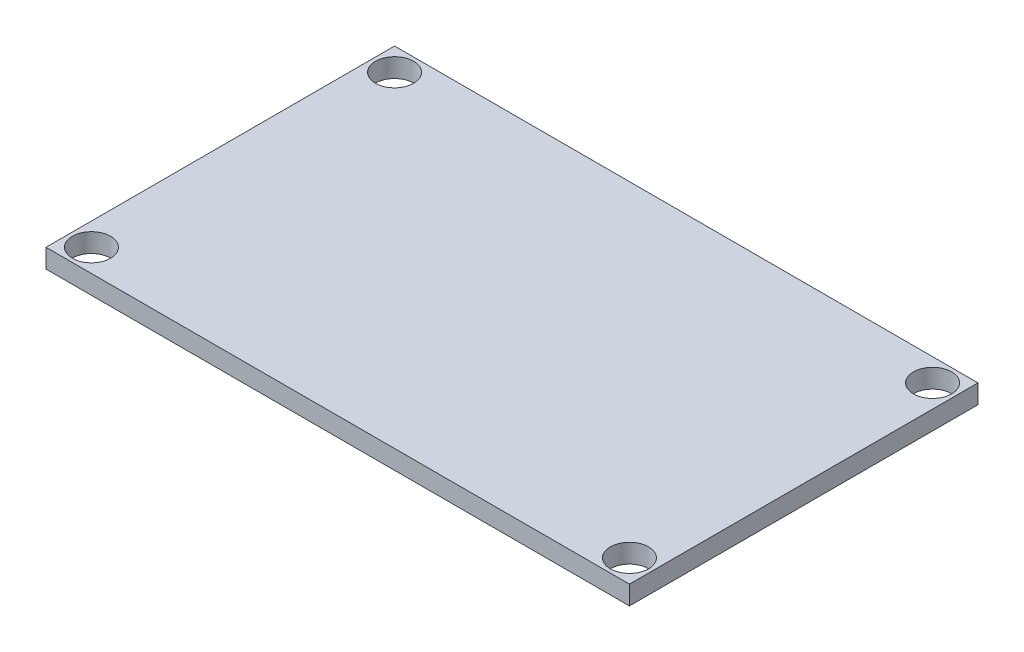
ISO-10303-21;
HEADER;
FILE_DESCRIPTION(('STEP AP214'),'2;1');
FILE_NAME('part.step','',(''),(''),'','','');
FILE_SCHEMA(('AUTOMOTIVE_DESIGN { 1 0 10303 214 1 1 1 1 }'));
ENDSEC;
DATA;
#1=APPLICATION_CONTEXT('core data for automotive mechanical design processes');
#2=APPLICATION_PROTOCOL_DEFINITION('international standard','automotive_design',2000,#1);
#3=PRODUCT_CONTEXT('',#1,'mechanical');
#4=PRODUCT('Part','Part','',(#3));
#5=PRODUCT_RELATED_PRODUCT_CATEGORY('part','',(#4));
#6=PRODUCT_DEFINITION_FORMATION('','',#4);
#7=PRODUCT_DEFINITION_CONTEXT('part definition',#1,'design');
#8=PRODUCT_DEFINITION('design','',#6,#7);
#9=PRODUCT_DEFINITION_SHAPE('','',#8);
#10=(LENGTH_UNIT() NAMED_UNIT(*) SI_UNIT(.MILLI.,.METRE.));
#11=(NAMED_UNIT(*) PLANE_ANGLE_UNIT() SI_UNIT($,.RADIAN.));
#12=(NAMED_UNIT(*) SI_UNIT($,.STERADIAN.) SOLID_ANGLE_UNIT());
#13=UNCERTAINTY_MEASURE_WITH_UNIT(LENGTH_MEASURE(1.E-05),#10,'distance_accuracy_value','');
#14=(GEOMETRIC_REPRESENTATION_CONTEXT(3) GLOBAL_UNCERTAINTY_ASSIGNED_CONTEXT((#13)) GLOBAL_UNIT_ASSIGNED_CONTEXT((#10,
#11,#12)) REPRESENTATION_CONTEXT('',''));
#15=CARTESIAN_POINT('',(0.,0.,0.));
#16=DIRECTION('',(0.,0.,1.));
#17=DIRECTION('',(1.,0.,0.));
#18=AXIS2_PLACEMENT_3D('',#15,#16,#17);
#19=CARTESIAN_POINT('',(0.,1.5875,0.));
#20=DIRECTION('',(0.,1.,0.));
#21=DIRECTION('',(0.,0.,1.));
#22=AXIS2_PLACEMENT_3D('',#19,#20,#21);
#23=PLANE('',#22);
#24=CARTESIAN_POINT('',(22.5425,1.5875,12.7));
#25=DIRECTION('',(0.,1.,0.));
#26=DIRECTION('',(0.,0.,1.));
#27=AXIS2_PLACEMENT_3D('',#24,#25,#26);
#28=CIRCLE('',#27,1.599999975);
#29=CARTESIAN_POINT('',(22.5425,1.5875,14.299999975));
#30=VERTEX_POINT('',#29);
#31=EDGE_CURVE('E121',#30,#30,#28,.T.);
#32=ORIENTED_EDGE('',*,*,#31,.F.);
#33=EDGE_LOOP('',(#32));
#34=FACE_BOUND('',#33,.T.);
#35=CARTESIAN_POINT('',(-22.5425,1.5875,-12.7));
#36=DIRECTION('',(0.,1.,0.));
#37=DIRECTION('',(0.,0.,1.));
#38=AXIS2_PLACEMENT_3D('',#35,#36,#37);
#39=CIRCLE('',#38,1.599999975);
#40=CARTESIAN_POINT('',(-22.5425,1.5875,-11.100000025));
#41=VERTEX_POINT('',#40);
#42=EDGE_CURVE('E100',#41,#41,#39,.T.);
#43=ORIENTED_EDGE('',*,*,#42,.F.);
#44=EDGE_LOOP('',(#43));
#45=FACE_BOUND('',#44,.T.);
#46=DIRECTION('',(0.,0.,-1.));
#47=VECTOR('',#46,1.);
#48=CARTESIAN_POINT('',(24.4475,1.5875,-14.605));
#49=LINE('',#48,#47);
#50=CARTESIAN_POINT('',(24.4475,1.5875,14.605));
#51=VERTEX_POINT('',#50);
#52=CARTESIAN_POINT('',(24.4475,1.5875,-14.605));
#53=VERTEX_POINT('',#52);
#54=EDGE_CURVE('E85',#51,#53,#49,.T.);
#55=ORIENTED_EDGE('',*,*,#54,.T.);
#56=DIRECTION('',(-1.,0.,0.));
#57=VECTOR('',#56,1.);
#58=CARTESIAN_POINT('',(-24.4475,1.5875,-14.605));
#59=LINE('',#58,#57);
#60=CARTESIAN_POINT('',(-24.4475,1.5875,-14.605));
#61=VERTEX_POINT('',#60);
#62=EDGE_CURVE('E80',#53,#61,#59,.T.);
#63=ORIENTED_EDGE('',*,*,#62,.T.);
#64=DIRECTION('',(0.,0.,1.));
#65=VECTOR('',#64,1.);
#66=CARTESIAN_POINT('',(-24.4475,1.5875,-14.605));
#67=LINE('',#66,#65);
#68=CARTESIAN_POINT('',(-24.4475,1.5875,14.605));
#69=VERTEX_POINT('',#68);
#70=EDGE_CURVE('E83',#61,#69,#67,.T.);
#71=ORIENTED_EDGE('',*,*,#70,.T.);
#72=DIRECTION('',(1.,0.,0.));
#73=VECTOR('',#72,1.);
#74=CARTESIAN_POINT('',(-24.4475,1.5875,14.605));
#75=LINE('',#74,#73);
#76=EDGE_CURVE('E50',#69,#51,#75,.T.);
#77=ORIENTED_EDGE('',*,*,#76,.T.);
#78=EDGE_LOOP('',(#55,#63,#71,#77));
#79=FACE_BOUND('',#78,.T.);
#80=CARTESIAN_POINT('',(-22.5425,1.5875,12.7));
#81=DIRECTION('',(0.,1.,0.));
#82=DIRECTION('',(0.,0.,1.));
#83=AXIS2_PLACEMENT_3D('',#80,#81,#82);
#84=CIRCLE('',#83,1.599999975);
#85=CARTESIAN_POINT('',(-22.5425,1.5875,14.299999975));
#86=VERTEX_POINT('',#85);
#87=EDGE_CURVE('E115',#86,#86,#84,.T.);
#88=ORIENTED_EDGE('',*,*,#87,.F.);
#89=EDGE_LOOP('',(#88));
#90=FACE_BOUND('',#89,.T.);
#91=CARTESIAN_POINT('',(22.5425,1.5875,-12.7));
#92=DIRECTION('',(0.,1.,0.));
#93=DIRECTION('',(0.,0.,1.));
#94=AXIS2_PLACEMENT_3D('',#91,#92,#93);
#95=CIRCLE('',#94,1.599999975);
#96=CARTESIAN_POINT('',(22.5425,1.5875,-11.100000025));
#97=VERTEX_POINT('',#96);
#98=EDGE_CURVE('E127',#97,#97,#95,.T.);
#99=ORIENTED_EDGE('',*,*,#98,.F.);
#100=EDGE_LOOP('',(#99));
#101=FACE_BOUND('',#100,.T.);
#102=ADVANCED_FACE('F33',(#34,#45,#79,#90,#101),#23,.T.);
#103=CARTESIAN_POINT('',(0.,0.,0.));
#104=DIRECTION('',(0.,1.,0.));
#105=DIRECTION('',(0.,0.,1.));
#106=AXIS2_PLACEMENT_3D('',#103,#104,#105);
#107=PLANE('',#106);
#108=DIRECTION('',(0.,0.,-1.));
#109=VECTOR('',#108,1.);
#110=CARTESIAN_POINT('',(24.4475,0.,-14.605));
#111=LINE('',#110,#109);
#112=CARTESIAN_POINT('',(24.4475,0.,14.605));
#113=VERTEX_POINT('',#112);
#114=CARTESIAN_POINT('',(24.4475,0.,-14.605));
#115=VERTEX_POINT('',#114);
#116=EDGE_CURVE('E97',#113,#115,#111,.T.);
#117=ORIENTED_EDGE('',*,*,#116,.F.);
#118=DIRECTION('',(1.,0.,0.));
#119=VECTOR('',#118,1.);
#120=CARTESIAN_POINT('',(-24.4475,0.,14.605));
#121=LINE('',#120,#119);
#122=CARTESIAN_POINT('',(-24.4475,0.,14.605));
#123=VERTEX_POINT('',#122);
#124=EDGE_CURVE('E73',#123,#113,#121,.T.);
#125=ORIENTED_EDGE('',*,*,#124,.F.);
#126=DIRECTION('',(0.,0.,1.));
#127=VECTOR('',#126,1.);
#128=CARTESIAN_POINT('',(-24.4475,0.,-14.605));
#129=LINE('',#128,#127);
#130=CARTESIAN_POINT('',(-24.4475,0.,-14.605));
#131=VERTEX_POINT('',#130);
#132=EDGE_CURVE('E67',#131,#123,#129,.T.);
#133=ORIENTED_EDGE('',*,*,#132,.F.);
#134=DIRECTION('',(-1.,0.,0.));
#135=VECTOR('',#134,1.);
#136=CARTESIAN_POINT('',(-24.4475,0.,-14.605));
#137=LINE('',#136,#135);
#138=EDGE_CURVE('E89',#115,#131,#137,.T.);
#139=ORIENTED_EDGE('',*,*,#138,.F.);
#140=EDGE_LOOP('',(#117,#125,#133,#139));
#141=FACE_BOUND('',#140,.T.);
#142=CARTESIAN_POINT('',(-22.5425,0.,-12.7));
#143=DIRECTION('',(0.,1.,0.));
#144=DIRECTION('',(0.,0.,1.));
#145=AXIS2_PLACEMENT_3D('',#142,#143,#144);
#146=CIRCLE('',#145,1.599999975);
#147=CARTESIAN_POINT('',(-22.5425,0.,-11.100000025));
#148=VERTEX_POINT('',#147);
#149=EDGE_CURVE('E112',#148,#148,#146,.T.);
#150=ORIENTED_EDGE('',*,*,#149,.T.);
#151=EDGE_LOOP('',(#150));
#152=FACE_BOUND('',#151,.T.);
#153=CARTESIAN_POINT('',(-22.5425,0.,12.7));
#154=DIRECTION('',(0.,1.,0.));
#155=DIRECTION('',(0.,0.,1.));
#156=AXIS2_PLACEMENT_3D('',#153,#154,#155);
#157=CIRCLE('',#156,1.599999975);
#158=CARTESIAN_POINT('',(-22.5425,0.,14.299999975));
#159=VERTEX_POINT('',#158);
#160=EDGE_CURVE('E118',#159,#159,#157,.T.);
#161=ORIENTED_EDGE('',*,*,#160,.T.);
#162=EDGE_LOOP('',(#161));
#163=FACE_BOUND('',#162,.T.);
#164=CARTESIAN_POINT('',(22.5425,0.,12.7));
#165=DIRECTION('',(0.,1.,0.));
#166=DIRECTION('',(0.,0.,1.));
#167=AXIS2_PLACEMENT_3D('',#164,#165,#166);
#168=CIRCLE('',#167,1.599999975);
#169=CARTESIAN_POINT('',(22.5425,0.,14.299999975));
#170=VERTEX_POINT('',#169);
#171=EDGE_CURVE('E124',#170,#170,#168,.T.);
#172=ORIENTED_EDGE('',*,*,#171,.T.);
#173=EDGE_LOOP('',(#172));
#174=FACE_BOUND('',#173,.T.);
#175=CARTESIAN_POINT('',(22.5425,0.,-12.7));
#176=DIRECTION('',(0.,1.,0.));
#177=DIRECTION('',(0.,0.,1.));
#178=AXIS2_PLACEMENT_3D('',#175,#176,#177);
#179=CIRCLE('',#178,1.599999975);
#180=CARTESIAN_POINT('',(22.5425,0.,-11.100000025));
#181=VERTEX_POINT('',#180);
#182=EDGE_CURVE('E130',#181,#181,#179,.T.);
#183=ORIENTED_EDGE('',*,*,#182,.T.);
#184=EDGE_LOOP('',(#183));
#185=FACE_BOUND('',#184,.T.);
#186=ADVANCED_FACE('F108',(#141,#152,#163,#174,#185),#107,.F.);
#187=CARTESIAN_POINT('',(24.4475,1.5875,-14.605));
#188=DIRECTION('',(-1.,0.,0.));
#189=DIRECTION('',(0.,0.,1.));
#190=AXIS2_PLACEMENT_3D('',#187,#188,#189);
#191=PLANE('',#190);
#192=ORIENTED_EDGE('',*,*,#116,.T.);
#193=DIRECTION('',(0.,-1.,0.));
#194=VECTOR('',#193,1.);
#195=CARTESIAN_POINT('',(24.4475,1.5875,-14.605));
#196=LINE('',#195,#194);
#197=EDGE_CURVE('E11',#53,#115,#196,.T.);
#198=ORIENTED_EDGE('',*,*,#197,.F.);
#199=ORIENTED_EDGE('',*,*,#54,.F.);
#200=DIRECTION('',(0.,-1.,0.));
#201=VECTOR('',#200,1.);
#202=CARTESIAN_POINT('',(24.4475,1.5875,14.605));
#203=LINE('',#202,#201);
#204=EDGE_CURVE('E93',#51,#113,#203,.T.);
#205=ORIENTED_EDGE('',*,*,#204,.T.);
#206=EDGE_LOOP('',(#192,#198,#199,#205));
#207=FACE_BOUND('',#206,.T.);
#208=ADVANCED_FACE('F35',(#207),#191,.F.);
#209=CARTESIAN_POINT('',(-24.4475,1.5875,-14.605));
#210=DIRECTION('',(0.,0.,1.));
#211=DIRECTION('',(1.,0.,0.));
#212=AXIS2_PLACEMENT_3D('',#209,#210,#211);
#213=PLANE('',#212);
#214=ORIENTED_EDGE('',*,*,#138,.T.);
#215=DIRECTION('',(0.,-1.,0.));
#216=VECTOR('',#215,1.);
#217=CARTESIAN_POINT('',(-24.4475,1.5875,-14.605));
#218=LINE('',#217,#216);
#219=EDGE_CURVE('E42',#61,#131,#218,.T.);
#220=ORIENTED_EDGE('',*,*,#219,.F.);
#221=ORIENTED_EDGE('',*,*,#62,.F.);
#222=ORIENTED_EDGE('',*,*,#197,.T.);
#223=EDGE_LOOP('',(#214,#220,#221,#222));
#224=FACE_BOUND('',#223,.T.);
#225=ADVANCED_FACE('F88',(#224),#213,.F.);
#226=CARTESIAN_POINT('',(-24.4475,1.5875,-14.605));
#227=DIRECTION('',(1.,0.,0.));
#228=DIRECTION('',(0.,0.,-1.));
#229=AXIS2_PLACEMENT_3D('',#226,#227,#228);
#230=PLANE('',#229);
#231=ORIENTED_EDGE('',*,*,#132,.T.);
#232=DIRECTION('',(0.,-1.,0.));
#233=VECTOR('',#232,1.);
#234=CARTESIAN_POINT('',(-24.4475,1.5875,14.605));
#235=LINE('',#234,#233);
#236=EDGE_CURVE('E90',#69,#123,#235,.T.);
#237=ORIENTED_EDGE('',*,*,#236,.F.);
#238=ORIENTED_EDGE('',*,*,#70,.F.);
#239=ORIENTED_EDGE('',*,*,#219,.T.);
#240=EDGE_LOOP('',(#231,#237,#238,#239));
#241=FACE_BOUND('',#240,.T.);
#242=ADVANCED_FACE('F91',(#241),#230,.F.);
#243=CARTESIAN_POINT('',(-24.4475,1.5875,14.605));
#244=DIRECTION('',(0.,0.,-1.));
#245=DIRECTION('',(-1.,0.,0.));
#246=AXIS2_PLACEMENT_3D('',#243,#244,#245);
#247=PLANE('',#246);
#248=ORIENTED_EDGE('',*,*,#124,.T.);
#249=ORIENTED_EDGE('',*,*,#204,.F.);
#250=ORIENTED_EDGE('',*,*,#76,.F.);
#251=ORIENTED_EDGE('',*,*,#236,.T.);
#252=EDGE_LOOP('',(#248,#249,#250,#251));
#253=FACE_BOUND('',#252,.T.);
#254=ADVANCED_FACE('F105',(#253),#247,.F.);
#255=CARTESIAN_POINT('',(-22.5425,1.5875,-12.7));
#256=DIRECTION('',(0.,-1.,0.));
#257=DIRECTION('',(0.,0.,-1.));
#258=AXIS2_PLACEMENT_3D('',#255,#256,#257);
#259=CYLINDRICAL_SURFACE('',#258,1.599999975);
#260=ORIENTED_EDGE('',*,*,#42,.T.);
#261=EDGE_LOOP('',(#260));
#262=FACE_BOUND('',#261,.T.);
#263=ORIENTED_EDGE('',*,*,#149,.F.);
#264=EDGE_LOOP('',(#263));
#265=FACE_BOUND('',#264,.T.);
#266=ADVANCED_FACE('F149',(#262,#265),#259,.F.);
#267=CARTESIAN_POINT('',(-22.5425,1.5875,12.7));
#268=DIRECTION('',(0.,-1.,0.));
#269=DIRECTION('',(0.,0.,-1.));
#270=AXIS2_PLACEMENT_3D('',#267,#268,#269);
#271=CYLINDRICAL_SURFACE('',#270,1.599999975);
#272=ORIENTED_EDGE('',*,*,#87,.T.);
#273=EDGE_LOOP('',(#272));
#274=FACE_BOUND('',#273,.T.);
#275=ORIENTED_EDGE('',*,*,#160,.F.);
#276=EDGE_LOOP('',(#275));
#277=FACE_BOUND('',#276,.T.);
#278=ADVANCED_FACE('F195',(#274,#277),#271,.F.);
#279=CARTESIAN_POINT('',(22.5425,1.5875,12.7));
#280=DIRECTION('',(0.,-1.,0.));
#281=DIRECTION('',(0.,0.,-1.));
#282=AXIS2_PLACEMENT_3D('',#279,#280,#281);
#283=CYLINDRICAL_SURFACE('',#282,1.599999975);
#284=ORIENTED_EDGE('',*,*,#31,.T.);
#285=EDGE_LOOP('',(#284));
#286=FACE_BOUND('',#285,.T.);
#287=ORIENTED_EDGE('',*,*,#171,.F.);
#288=EDGE_LOOP('',(#287));
#289=FACE_BOUND('',#288,.T.);
#290=ADVANCED_FACE('F203',(#286,#289),#283,.F.);
#291=CARTESIAN_POINT('',(22.5425,1.5875,-12.7));
#292=DIRECTION('',(0.,-1.,0.));
#293=DIRECTION('',(0.,0.,-1.));
#294=AXIS2_PLACEMENT_3D('',#291,#292,#293);
#295=CYLINDRICAL_SURFACE('',#294,1.599999975);
#296=ORIENTED_EDGE('',*,*,#98,.T.);
#297=EDGE_LOOP('',(#296));
#298=FACE_BOUND('',#297,.T.);
#299=ORIENTED_EDGE('',*,*,#182,.F.);
#300=EDGE_LOOP('',(#299));
#301=FACE_BOUND('',#300,.T.);
#302=ADVANCED_FACE('F136',(#298,#301),#295,.F.);
#303=CLOSED_SHELL('',(#102,#186,#208,#225,#242,#254,#266,#278,#290,#302));
#304=MANIFOLD_SOLID_BREP('B2',#303);
#305=ADVANCED_BREP_SHAPE_REPRESENTATION('',(#18,#304),#14);
#306=SHAPE_DEFINITION_REPRESENTATION(#9,#305);
ENDSEC;
END-ISO-10303-21;
